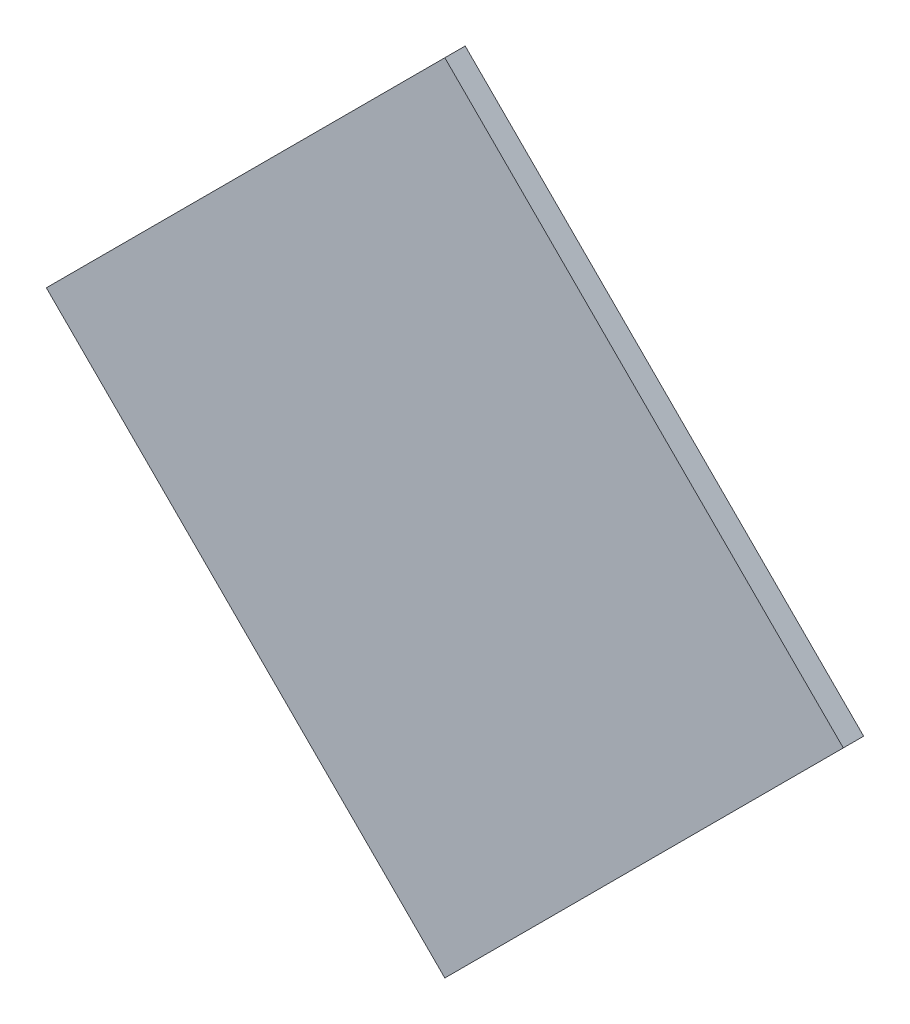
ISO-10303-21;
HEADER;
FILE_DESCRIPTION(('STEP AP214'),'2;1');
FILE_NAME('part.step','',(''),(''),'','','');
FILE_SCHEMA(('AUTOMOTIVE_DESIGN { 1 0 10303 214 1 1 1 1 }'));
ENDSEC;
DATA;
#1=APPLICATION_CONTEXT('core data for automotive mechanical design processes');
#2=APPLICATION_PROTOCOL_DEFINITION('international standard','automotive_design',2000,#1);
#3=PRODUCT_CONTEXT('',#1,'mechanical');
#4=PRODUCT('Part','Part','',(#3));
#5=PRODUCT_RELATED_PRODUCT_CATEGORY('part','',(#4));
#6=PRODUCT_DEFINITION_FORMATION('','',#4);
#7=PRODUCT_DEFINITION_CONTEXT('part definition',#1,'design');
#8=PRODUCT_DEFINITION('design','',#6,#7);
#9=PRODUCT_DEFINITION_SHAPE('','',#8);
#10=(LENGTH_UNIT() NAMED_UNIT(*) SI_UNIT(.MILLI.,.METRE.));
#11=(NAMED_UNIT(*) PLANE_ANGLE_UNIT() SI_UNIT($,.RADIAN.));
#12=(NAMED_UNIT(*) SI_UNIT($,.STERADIAN.) SOLID_ANGLE_UNIT());
#13=UNCERTAINTY_MEASURE_WITH_UNIT(LENGTH_MEASURE(1.E-05),#10,'distance_accuracy_value','');
#14=(GEOMETRIC_REPRESENTATION_CONTEXT(3) GLOBAL_UNCERTAINTY_ASSIGNED_CONTEXT((#13)) GLOBAL_UNIT_ASSIGNED_CONTEXT((#10,
#11,#12)) REPRESENTATION_CONTEXT('',''));
#15=CARTESIAN_POINT('',(0.,0.,0.));
#16=DIRECTION('',(0.,0.,1.));
#17=DIRECTION('',(1.,0.,0.));
#18=AXIS2_PLACEMENT_3D('',#15,#16,#17);
#19=CARTESIAN_POINT('',(5.28167,5.06167,0.79916));
#20=DIRECTION('',(0.,0.,1.));
#21=DIRECTION('',(0.,-1.,0.));
#22=AXIS2_PLACEMENT_3D('',#19,#20,#21);
#23=PLANE('',#22);
#24=DIRECTION('',(0.707106781186548,0.707106781186548,0.));
#25=VECTOR('',#24,1.);
#26=CARTESIAN_POINT('',(4.609918667,5.06167,0.79916));
#27=LINE('',#26,#25);
#28=CARTESIAN_POINT('',(5.28167,5.733421333,0.79916));
#29=VERTEX_POINT('',#28);
#30=CARTESIAN_POINT('',(4.609918667,5.06167,0.79916));
#31=VERTEX_POINT('',#30);
#32=EDGE_CURVE('E68',#29,#31,#27,.F.);
#33=ORIENTED_EDGE('',*,*,#32,.T.);
#34=DIRECTION('',(-0.707106781186548,0.707106781186548,0.));
#35=VECTOR('',#34,1.);
#36=CARTESIAN_POINT('',(5.28167,4.389918667,0.79916));
#37=LINE('',#36,#35);
#38=CARTESIAN_POINT('',(5.28167,4.389918667,0.79916));
#39=VERTEX_POINT('',#38);
#40=EDGE_CURVE('E55',#31,#39,#37,.F.);
#41=ORIENTED_EDGE('',*,*,#40,.T.);
#42=DIRECTION('',(-0.707106781186548,-0.707106781186548,0.));
#43=VECTOR('',#42,1.);
#44=CARTESIAN_POINT('',(5.953421333,5.06167,0.79916));
#45=LINE('',#44,#43);
#46=CARTESIAN_POINT('',(5.953421333,5.06167,0.79916));
#47=VERTEX_POINT('',#46);
#48=EDGE_CURVE('E20',#39,#47,#45,.F.);
#49=ORIENTED_EDGE('',*,*,#48,.T.);
#50=DIRECTION('',(0.707106781186548,-0.707106781186548,0.));
#51=VECTOR('',#50,1.);
#52=CARTESIAN_POINT('',(5.28167,5.733421333,0.79916));
#53=LINE('',#52,#51);
#54=EDGE_CURVE('E81',#47,#29,#53,.F.);
#55=ORIENTED_EDGE('',*,*,#54,.T.);
#56=EDGE_LOOP('',(#33,#41,#49,#55));
#57=FACE_BOUND('',#56,.T.);
#58=ADVANCED_FACE('F17',(#57),#23,.T.);
#59=CARTESIAN_POINT('',(5.953421333,5.06167,0.76487));
#60=DIRECTION('',(-0.707106781186548,0.707106781186548,0.));
#61=DIRECTION('',(-0.707106781186548,-0.707106781186548,0.));
#62=AXIS2_PLACEMENT_3D('',#59,#60,#61);
#63=PLANE('',#62);
#64=DIRECTION('',(0.,0.,1.));
#65=VECTOR('',#64,1.);
#66=CARTESIAN_POINT('',(5.28167,4.389918667,0.76487));
#67=LINE('',#66,#65);
#68=CARTESIAN_POINT('',(5.28167,4.389918667,0.76487));
#69=VERTEX_POINT('',#68);
#70=EDGE_CURVE('E61',#39,#69,#67,.F.);
#71=ORIENTED_EDGE('',*,*,#70,.T.);
#72=DIRECTION('',(-0.707106781186547,-0.707106781186549,0.));
#73=VECTOR('',#72,1.);
#74=CARTESIAN_POINT('',(5.953421333,5.06167,0.76487));
#75=LINE('',#74,#73);
#76=CARTESIAN_POINT('',(5.953421333,5.06167,0.76487));
#77=VERTEX_POINT('',#76);
#78=EDGE_CURVE('E83',#77,#69,#75,.T.);
#79=ORIENTED_EDGE('',*,*,#78,.F.);
#80=DIRECTION('',(0.,0.,1.));
#81=VECTOR('',#80,1.);
#82=CARTESIAN_POINT('',(5.953421333,5.06167,0.76487));
#83=LINE('',#82,#81);
#84=EDGE_CURVE('E64',#77,#47,#83,.T.);
#85=ORIENTED_EDGE('',*,*,#84,.T.);
#86=ORIENTED_EDGE('',*,*,#48,.F.);
#87=EDGE_LOOP('',(#71,#79,#85,#86));
#88=FACE_BOUND('',#87,.T.);
#89=ADVANCED_FACE('F60',(#88),#63,.F.);
#90=CARTESIAN_POINT('',(5.28167,4.389918667,0.76487));
#91=DIRECTION('',(0.707106781186548,0.707106781186548,0.));
#92=DIRECTION('',(-0.707106781186548,0.707106781186548,0.));
#93=AXIS2_PLACEMENT_3D('',#90,#91,#92);
#94=PLANE('',#93);
#95=DIRECTION('',(0.,0.,1.));
#96=VECTOR('',#95,1.);
#97=CARTESIAN_POINT('',(4.609918667,5.06167,0.76487));
#98=LINE('',#97,#96);
#99=CARTESIAN_POINT('',(4.609918667,5.06167,0.76487));
#100=VERTEX_POINT('',#99);
#101=EDGE_CURVE('E70',#31,#100,#98,.F.);
#102=ORIENTED_EDGE('',*,*,#101,.T.);
#103=DIRECTION('',(-0.707106781186547,0.707106781186547,0.));
#104=VECTOR('',#103,1.);
#105=CARTESIAN_POINT('',(5.28167,4.389918667,0.76487));
#106=LINE('',#105,#104);
#107=EDGE_CURVE('E74',#69,#100,#106,.T.);
#108=ORIENTED_EDGE('',*,*,#107,.F.);
#109=ORIENTED_EDGE('',*,*,#70,.F.);
#110=ORIENTED_EDGE('',*,*,#40,.F.);
#111=EDGE_LOOP('',(#102,#108,#109,#110));
#112=FACE_BOUND('',#111,.T.);
#113=ADVANCED_FACE('F72',(#112),#94,.F.);
#114=CARTESIAN_POINT('',(4.609918667,5.06167,0.76487));
#115=DIRECTION('',(0.707106781186548,-0.707106781186548,0.));
#116=DIRECTION('',(0.707106781186548,0.707106781186548,0.));
#117=AXIS2_PLACEMENT_3D('',#114,#115,#116);
#118=PLANE('',#117);
#119=DIRECTION('',(0.,0.,1.));
#120=VECTOR('',#119,1.);
#121=CARTESIAN_POINT('',(5.28167,5.733421333,0.76487));
#122=LINE('',#121,#120);
#123=CARTESIAN_POINT('',(5.28167,5.733421333,0.76487));
#124=VERTEX_POINT('',#123);
#125=EDGE_CURVE('E35',#29,#124,#122,.F.);
#126=ORIENTED_EDGE('',*,*,#125,.T.);
#127=DIRECTION('',(0.707106781186549,0.707106781186547,0.));
#128=VECTOR('',#127,1.);
#129=CARTESIAN_POINT('',(4.609918667,5.06167,0.76487));
#130=LINE('',#129,#128);
#131=EDGE_CURVE('E26',#100,#124,#130,.T.);
#132=ORIENTED_EDGE('',*,*,#131,.F.);
#133=ORIENTED_EDGE('',*,*,#101,.F.);
#134=ORIENTED_EDGE('',*,*,#32,.F.);
#135=EDGE_LOOP('',(#126,#132,#133,#134));
#136=FACE_BOUND('',#135,.T.);
#137=ADVANCED_FACE('F89',(#136),#118,.F.);
#138=CARTESIAN_POINT('',(5.28167,5.733421333,0.76487));
#139=DIRECTION('',(-0.707106781186548,-0.707106781186548,0.));
#140=DIRECTION('',(0.707106781186548,-0.707106781186548,0.));
#141=AXIS2_PLACEMENT_3D('',#138,#139,#140);
#142=PLANE('',#141);
#143=ORIENTED_EDGE('',*,*,#84,.F.);
#144=DIRECTION('',(0.707106781186548,-0.707106781186548,0.));
#145=VECTOR('',#144,1.);
#146=CARTESIAN_POINT('',(5.28167,5.733421333,0.76487));
#147=LINE('',#146,#145);
#148=EDGE_CURVE('E11',#124,#77,#147,.T.);
#149=ORIENTED_EDGE('',*,*,#148,.F.);
#150=ORIENTED_EDGE('',*,*,#125,.F.);
#151=ORIENTED_EDGE('',*,*,#54,.F.);
#152=EDGE_LOOP('',(#143,#149,#150,#151));
#153=FACE_BOUND('',#152,.T.);
#154=ADVANCED_FACE('F91',(#153),#142,.F.);
#155=CARTESIAN_POINT('',(5.28167,5.06167,0.76487));
#156=DIRECTION('',(0.,0.,-1.));
#157=DIRECTION('',(0.,1.,0.));
#158=AXIS2_PLACEMENT_3D('',#155,#156,#157);
#159=PLANE('',#158);
#160=ORIENTED_EDGE('',*,*,#131,.T.);
#161=ORIENTED_EDGE('',*,*,#148,.T.);
#162=ORIENTED_EDGE('',*,*,#78,.T.);
#163=ORIENTED_EDGE('',*,*,#107,.T.);
#164=EDGE_LOOP('',(#160,#161,#162,#163));
#165=FACE_BOUND('',#164,.T.);
#166=ADVANCED_FACE('F88',(#165),#159,.T.);
#167=CLOSED_SHELL('',(#58,#89,#113,#137,#154,#166));
#168=MANIFOLD_SOLID_BREP('B1',#167);
#169=ADVANCED_BREP_SHAPE_REPRESENTATION('',(#18,#168),#14);
#170=SHAPE_DEFINITION_REPRESENTATION(#9,#169);
ENDSEC;
END-ISO-10303-21;
